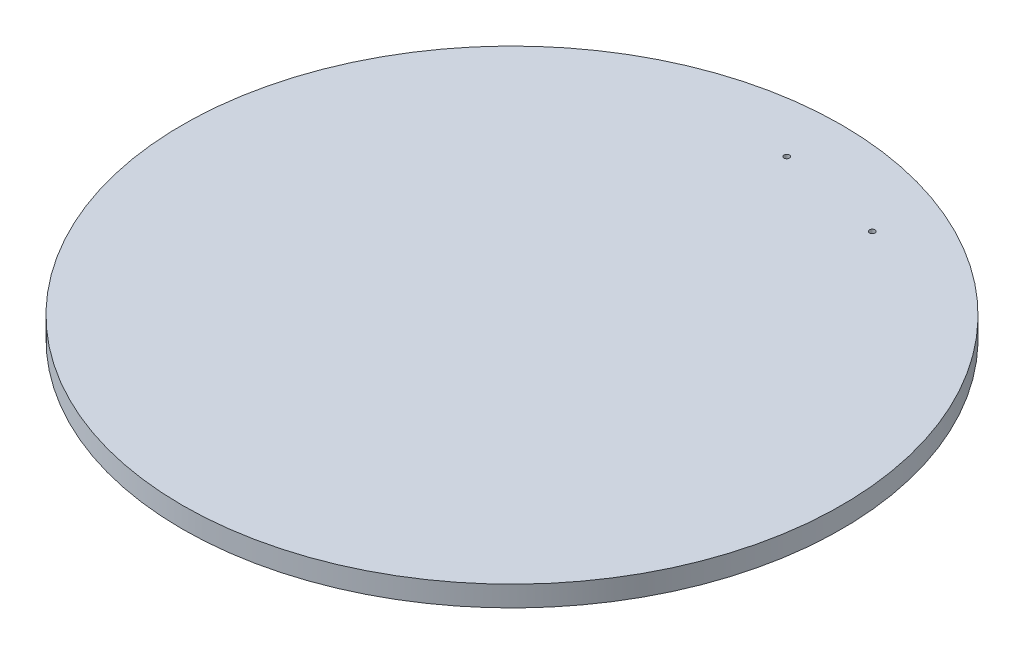
ISO-10303-21;
HEADER;
FILE_DESCRIPTION(('STEP AP214'),'2;1');
FILE_NAME('part.step','',(''),(''),'','','');
FILE_SCHEMA(('AUTOMOTIVE_DESIGN { 1 0 10303 214 1 1 1 1 }'));
ENDSEC;
DATA;
#1=APPLICATION_CONTEXT('core data for automotive mechanical design processes');
#2=APPLICATION_PROTOCOL_DEFINITION('international standard','automotive_design',2000,#1);
#3=PRODUCT_CONTEXT('',#1,'mechanical');
#4=PRODUCT('Part','Part','',(#3));
#5=PRODUCT_RELATED_PRODUCT_CATEGORY('part','',(#4));
#6=PRODUCT_DEFINITION_FORMATION('','',#4);
#7=PRODUCT_DEFINITION_CONTEXT('part definition',#1,'design');
#8=PRODUCT_DEFINITION('design','',#6,#7);
#9=PRODUCT_DEFINITION_SHAPE('','',#8);
#10=(LENGTH_UNIT() NAMED_UNIT(*) SI_UNIT(.MILLI.,.METRE.));
#11=(NAMED_UNIT(*) PLANE_ANGLE_UNIT() SI_UNIT($,.RADIAN.));
#12=(NAMED_UNIT(*) SI_UNIT($,.STERADIAN.) SOLID_ANGLE_UNIT());
#13=UNCERTAINTY_MEASURE_WITH_UNIT(LENGTH_MEASURE(1.E-05),#10,'distance_accuracy_value','');
#14=(GEOMETRIC_REPRESENTATION_CONTEXT(3) GLOBAL_UNCERTAINTY_ASSIGNED_CONTEXT((#13)) GLOBAL_UNIT_ASSIGNED_CONTEXT((#10,
#11,#12)) REPRESENTATION_CONTEXT('',''));
#15=CARTESIAN_POINT('',(0.,0.,0.));
#16=DIRECTION('',(0.,0.,1.));
#17=DIRECTION('',(1.,0.,0.));
#18=AXIS2_PLACEMENT_3D('',#15,#16,#17);
#19=CARTESIAN_POINT('',(0.,19.05,0.));
#20=DIRECTION('',(0.,-1.,0.));
#21=DIRECTION('',(0.,0.,-1.));
#22=AXIS2_PLACEMENT_3D('',#19,#20,#21);
#23=CYLINDRICAL_SURFACE('',#22,304.8);
#24=CARTESIAN_POINT('',(0.,19.05,0.));
#25=DIRECTION('',(0.,1.,0.));
#26=DIRECTION('',(0.,0.,1.));
#27=AXIS2_PLACEMENT_3D('',#24,#25,#26);
#28=CIRCLE('',#27,304.8);
#29=CARTESIAN_POINT('',(0.,19.05,304.8));
#30=VERTEX_POINT('',#29);
#31=EDGE_CURVE('E10',#30,#30,#28,.T.);
#32=ORIENTED_EDGE('',*,*,#31,.F.);
#33=EDGE_LOOP('',(#32));
#34=FACE_BOUND('',#33,.T.);
#35=CARTESIAN_POINT('',(0.,0.,0.));
#36=DIRECTION('',(0.,1.,0.));
#37=DIRECTION('',(0.,0.,1.));
#38=AXIS2_PLACEMENT_3D('',#35,#36,#37);
#39=CIRCLE('',#38,304.8);
#40=CARTESIAN_POINT('',(0.,0.,304.8));
#41=VERTEX_POINT('',#40);
#42=EDGE_CURVE('E41',#41,#41,#39,.T.);
#43=ORIENTED_EDGE('',*,*,#42,.T.);
#44=EDGE_LOOP('',(#43));
#45=FACE_BOUND('',#44,.T.);
#46=ADVANCED_FACE('F38',(#34,#45),#23,.T.);
#47=CARTESIAN_POINT('',(0.,19.05,0.));
#48=DIRECTION('',(0.,1.,0.));
#49=DIRECTION('',(0.,0.,1.));
#50=AXIS2_PLACEMENT_3D('',#47,#48,#49);
#51=PLANE('',#50);
#52=CARTESIAN_POINT('',(0.,19.05,-254.));
#53=DIRECTION('',(0.,1.,0.));
#54=DIRECTION('',(0.,0.,1.));
#55=AXIS2_PLACEMENT_3D('',#52,#53,#54);
#56=CIRCLE('',#55,2.54000000000001);
#57=CARTESIAN_POINT('',(0.,19.05,-251.46));
#58=VERTEX_POINT('',#57);
#59=EDGE_CURVE('E60',#58,#58,#56,.T.);
#60=ORIENTED_EDGE('',*,*,#59,.F.);
#61=EDGE_LOOP('',(#60));
#62=FACE_BOUND('',#61,.T.);
#63=CARTESIAN_POINT('',(99.5472631467084,19.05,-233.68));
#64=DIRECTION('',(0.,1.,0.));
#65=DIRECTION('',(0.,0.,1.));
#66=AXIS2_PLACEMENT_3D('',#63,#64,#65);
#67=CIRCLE('',#66,2.54000000000001);
#68=CARTESIAN_POINT('',(99.5472631467084,19.05,-231.14));
#69=VERTEX_POINT('',#68);
#70=EDGE_CURVE('E52',#69,#69,#67,.T.);
#71=ORIENTED_EDGE('',*,*,#70,.F.);
#72=EDGE_LOOP('',(#71));
#73=FACE_BOUND('',#72,.T.);
#74=ORIENTED_EDGE('',*,*,#31,.T.);
#75=EDGE_LOOP('',(#74));
#76=FACE_BOUND('',#75,.T.);
#77=ADVANCED_FACE('F78',(#62,#73,#76),#51,.T.);
#78=CARTESIAN_POINT('',(0.,0.,0.));
#79=DIRECTION('',(0.,1.,0.));
#80=DIRECTION('',(0.,0.,1.));
#81=AXIS2_PLACEMENT_3D('',#78,#79,#80);
#82=PLANE('',#81);
#83=CARTESIAN_POINT('',(0.,0.,-254.));
#84=DIRECTION('',(0.,1.,0.));
#85=DIRECTION('',(0.,0.,1.));
#86=AXIS2_PLACEMENT_3D('',#83,#84,#85);
#87=CIRCLE('',#86,2.54000000000001);
#88=CARTESIAN_POINT('',(0.,0.,-251.46));
#89=VERTEX_POINT('',#88);
#90=EDGE_CURVE('E50',#89,#89,#87,.T.);
#91=ORIENTED_EDGE('',*,*,#90,.T.);
#92=EDGE_LOOP('',(#91));
#93=FACE_BOUND('',#92,.T.);
#94=CARTESIAN_POINT('',(99.5472631467084,0.,-233.68));
#95=DIRECTION('',(0.,1.,0.));
#96=DIRECTION('',(0.,0.,1.));
#97=AXIS2_PLACEMENT_3D('',#94,#95,#96);
#98=CIRCLE('',#97,2.54000000000001);
#99=CARTESIAN_POINT('',(99.5472631467084,0.,-231.14));
#100=VERTEX_POINT('',#99);
#101=EDGE_CURVE('E56',#100,#100,#98,.T.);
#102=ORIENTED_EDGE('',*,*,#101,.T.);
#103=EDGE_LOOP('',(#102));
#104=FACE_BOUND('',#103,.T.);
#105=ORIENTED_EDGE('',*,*,#42,.F.);
#106=EDGE_LOOP('',(#105));
#107=FACE_BOUND('',#106,.T.);
#108=ADVANCED_FACE('F68',(#93,#104,#107),#82,.F.);
#109=CARTESIAN_POINT('',(99.5472631467084,0.,-233.68));
#110=DIRECTION('',(0.,1.,0.));
#111=DIRECTION('',(0.,0.,1.));
#112=AXIS2_PLACEMENT_3D('',#109,#110,#111);
#113=CYLINDRICAL_SURFACE('',#112,2.54000000000001);
#114=ORIENTED_EDGE('',*,*,#101,.F.);
#115=EDGE_LOOP('',(#114));
#116=FACE_BOUND('',#115,.T.);
#117=ORIENTED_EDGE('',*,*,#70,.T.);
#118=EDGE_LOOP('',(#117));
#119=FACE_BOUND('',#118,.T.);
#120=ADVANCED_FACE('F74',(#116,#119),#113,.F.);
#121=CARTESIAN_POINT('',(0.,0.,-254.));
#122=DIRECTION('',(0.,1.,0.));
#123=DIRECTION('',(0.,0.,1.));
#124=AXIS2_PLACEMENT_3D('',#121,#122,#123);
#125=CYLINDRICAL_SURFACE('',#124,2.54000000000001);
#126=ORIENTED_EDGE('',*,*,#90,.F.);
#127=EDGE_LOOP('',(#126));
#128=FACE_BOUND('',#127,.T.);
#129=ORIENTED_EDGE('',*,*,#59,.T.);
#130=EDGE_LOOP('',(#129));
#131=FACE_BOUND('',#130,.T.);
#132=ADVANCED_FACE('F71',(#128,#131),#125,.F.);
#133=CLOSED_SHELL('',(#46,#77,#108,#120,#132));
#134=MANIFOLD_SOLID_BREP('B2',#133);
#135=ADVANCED_BREP_SHAPE_REPRESENTATION('',(#18,#134),#14);
#136=SHAPE_DEFINITION_REPRESENTATION(#9,#135);
ENDSEC;
END-ISO-10303-21;
